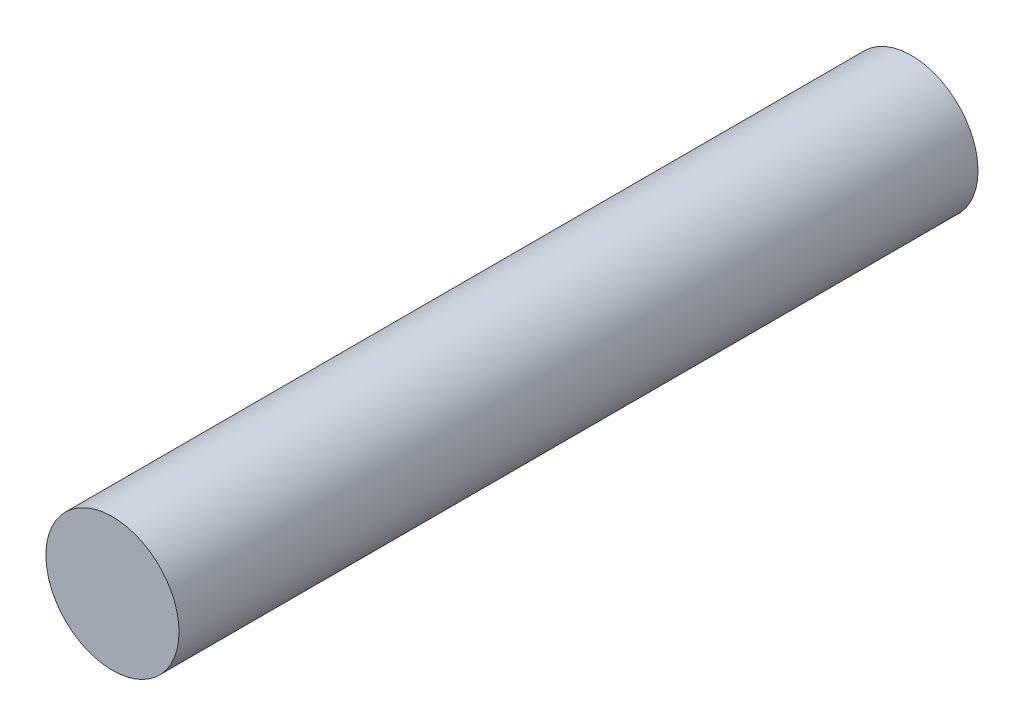
ISO-10303-21;
HEADER;
FILE_DESCRIPTION(('STEP AP214'),'2;1');
FILE_NAME('part.step','',(''),(''),'','','');
FILE_SCHEMA(('AUTOMOTIVE_DESIGN { 1 0 10303 214 1 1 1 1 }'));
ENDSEC;
DATA;
#1=APPLICATION_CONTEXT('core data for automotive mechanical design processes');
#2=APPLICATION_PROTOCOL_DEFINITION('international standard','automotive_design',2000,#1);
#3=PRODUCT_CONTEXT('',#1,'mechanical');
#4=PRODUCT('Part','Part','',(#3));
#5=PRODUCT_RELATED_PRODUCT_CATEGORY('part','',(#4));
#6=PRODUCT_DEFINITION_FORMATION('','',#4);
#7=PRODUCT_DEFINITION_CONTEXT('part definition',#1,'design');
#8=PRODUCT_DEFINITION('design','',#6,#7);
#9=PRODUCT_DEFINITION_SHAPE('','',#8);
#10=(LENGTH_UNIT() NAMED_UNIT(*) SI_UNIT(.MILLI.,.METRE.));
#11=(NAMED_UNIT(*) PLANE_ANGLE_UNIT() SI_UNIT($,.RADIAN.));
#12=(NAMED_UNIT(*) SI_UNIT($,.STERADIAN.) SOLID_ANGLE_UNIT());
#13=UNCERTAINTY_MEASURE_WITH_UNIT(LENGTH_MEASURE(1.E-05),#10,'distance_accuracy_value','');
#14=(GEOMETRIC_REPRESENTATION_CONTEXT(3) GLOBAL_UNCERTAINTY_ASSIGNED_CONTEXT((#13)) GLOBAL_UNIT_ASSIGNED_CONTEXT((#10,
#11,#12)) REPRESENTATION_CONTEXT('',''));
#15=CARTESIAN_POINT('',(0.,0.,0.));
#16=DIRECTION('',(0.,0.,1.));
#17=DIRECTION('',(1.,0.,0.));
#18=AXIS2_PLACEMENT_3D('',#15,#16,#17);
#19=CARTESIAN_POINT('',(0.,0.,12.));
#20=DIRECTION('',(0.,0.,-1.));
#21=DIRECTION('',(-1.,0.,0.));
#22=AXIS2_PLACEMENT_3D('',#19,#20,#21);
#23=CYLINDRICAL_SURFACE('',#22,1.);
#24=CARTESIAN_POINT('',(0.,0.,12.));
#25=DIRECTION('',(0.,0.,1.));
#26=DIRECTION('',(1.,0.,0.));
#27=AXIS2_PLACEMENT_3D('',#24,#25,#26);
#28=CIRCLE('',#27,1.);
#29=CARTESIAN_POINT('',(1.,0.,12.));
#30=VERTEX_POINT('',#29);
#31=EDGE_CURVE('E10',#30,#30,#28,.T.);
#32=ORIENTED_EDGE('',*,*,#31,.F.);
#33=EDGE_LOOP('',(#32));
#34=FACE_BOUND('',#33,.T.);
#35=CARTESIAN_POINT('',(0.,0.,0.));
#36=DIRECTION('',(0.,0.,1.));
#37=DIRECTION('',(1.,0.,0.));
#38=AXIS2_PLACEMENT_3D('',#35,#36,#37);
#39=CIRCLE('',#38,1.);
#40=CARTESIAN_POINT('',(1.,0.,0.));
#41=VERTEX_POINT('',#40);
#42=EDGE_CURVE('E37',#41,#41,#39,.T.);
#43=ORIENTED_EDGE('',*,*,#42,.T.);
#44=EDGE_LOOP('',(#43));
#45=FACE_BOUND('',#44,.T.);
#46=ADVANCED_FACE('F34',(#34,#45),#23,.T.);
#47=CARTESIAN_POINT('',(0.,0.,12.));
#48=DIRECTION('',(0.,0.,1.));
#49=DIRECTION('',(1.,0.,0.));
#50=AXIS2_PLACEMENT_3D('',#47,#48,#49);
#51=PLANE('',#50);
#52=ORIENTED_EDGE('',*,*,#31,.T.);
#53=EDGE_LOOP('',(#52));
#54=FACE_BOUND('',#53,.T.);
#55=ADVANCED_FACE('F49',(#54),#51,.T.);
#56=CARTESIAN_POINT('',(0.,0.,0.));
#57=DIRECTION('',(0.,0.,1.));
#58=DIRECTION('',(1.,0.,0.));
#59=AXIS2_PLACEMENT_3D('',#56,#57,#58);
#60=PLANE('',#59);
#61=ORIENTED_EDGE('',*,*,#42,.F.);
#62=EDGE_LOOP('',(#61));
#63=FACE_BOUND('',#62,.T.);
#64=ADVANCED_FACE('F47',(#63),#60,.F.);
#65=CLOSED_SHELL('',(#46,#55,#64));
#66=MANIFOLD_SOLID_BREP('B2',#65);
#67=ADVANCED_BREP_SHAPE_REPRESENTATION('',(#18,#66),#14);
#68=SHAPE_DEFINITION_REPRESENTATION(#9,#67);
ENDSEC;
END-ISO-10303-21;
